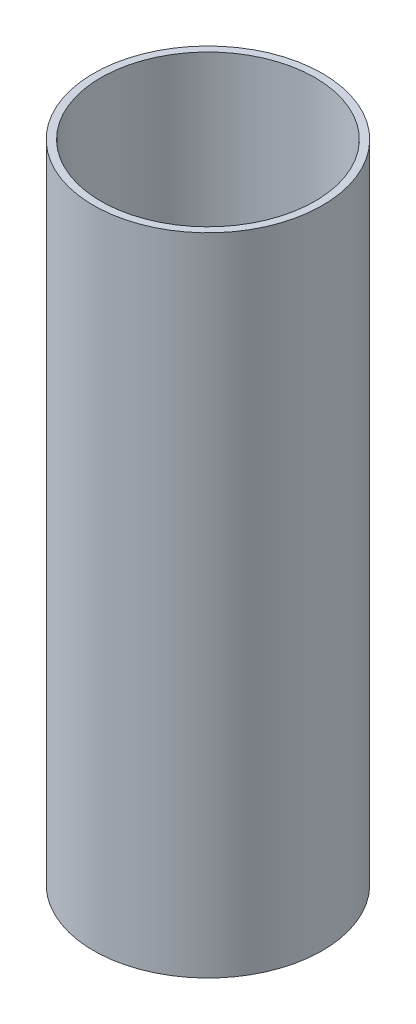
ISO-10303-21;
HEADER;
FILE_DESCRIPTION(('STEP AP214'),'2;1');
FILE_NAME('part.step','',(''),(''),'','','');
FILE_SCHEMA(('AUTOMOTIVE_DESIGN { 1 0 10303 214 1 1 1 1 }'));
ENDSEC;
DATA;
#1=APPLICATION_CONTEXT('core data for automotive mechanical design processes');
#2=APPLICATION_PROTOCOL_DEFINITION('international standard','automotive_design',2000,#1);
#3=PRODUCT_CONTEXT('',#1,'mechanical');
#4=PRODUCT('Part','Part','',(#3));
#5=PRODUCT_RELATED_PRODUCT_CATEGORY('part','',(#4));
#6=PRODUCT_DEFINITION_FORMATION('','',#4);
#7=PRODUCT_DEFINITION_CONTEXT('part definition',#1,'design');
#8=PRODUCT_DEFINITION('design','',#6,#7);
#9=PRODUCT_DEFINITION_SHAPE('','',#8);
#10=(LENGTH_UNIT() NAMED_UNIT(*) SI_UNIT(.MILLI.,.METRE.));
#11=(NAMED_UNIT(*) PLANE_ANGLE_UNIT() SI_UNIT($,.RADIAN.));
#12=(NAMED_UNIT(*) SI_UNIT($,.STERADIAN.) SOLID_ANGLE_UNIT());
#13=UNCERTAINTY_MEASURE_WITH_UNIT(LENGTH_MEASURE(1.E-05),#10,'distance_accuracy_value','');
#14=(GEOMETRIC_REPRESENTATION_CONTEXT(3) GLOBAL_UNCERTAINTY_ASSIGNED_CONTEXT((#13)) GLOBAL_UNIT_ASSIGNED_CONTEXT((#10,
#11,#12)) REPRESENTATION_CONTEXT('',''));
#15=CARTESIAN_POINT('',(0.,0.,0.));
#16=DIRECTION('',(0.,0.,1.));
#17=DIRECTION('',(1.,0.,0.));
#18=AXIS2_PLACEMENT_3D('',#15,#16,#17);
#19=CARTESIAN_POINT('',(0.,-13.97,0.));
#20=DIRECTION('',(0.,-1.,0.));
#21=DIRECTION('',(0.,0.,-1.));
#22=AXIS2_PLACEMENT_3D('',#19,#20,#21);
#23=CYLINDRICAL_SURFACE('',#22,46.355);
#24=CARTESIAN_POINT('',(0.,0.,0.));
#25=DIRECTION('',(0.,-1.,0.));
#26=DIRECTION('',(0.,0.,-1.));
#27=AXIS2_PLACEMENT_3D('',#24,#25,#26);
#28=CIRCLE('',#27,46.355);
#29=CARTESIAN_POINT('',(0.,0.,-46.355));
#30=VERTEX_POINT('',#29);
#31=EDGE_CURVE('E50',#30,#30,#28,.T.);
#32=ORIENTED_EDGE('',*,*,#31,.T.);
#33=EDGE_LOOP('',(#32));
#34=FACE_BOUND('',#33,.T.);
#35=CARTESIAN_POINT('',(0.,279.4,0.));
#36=DIRECTION('',(0.,-1.,0.));
#37=DIRECTION('',(0.,0.,-1.));
#38=AXIS2_PLACEMENT_3D('',#35,#36,#37);
#39=CIRCLE('',#38,46.355);
#40=CARTESIAN_POINT('',(0.,279.4,-46.355));
#41=VERTEX_POINT('',#40);
#42=EDGE_CURVE('E10',#41,#41,#39,.T.);
#43=ORIENTED_EDGE('',*,*,#42,.F.);
#44=EDGE_LOOP('',(#43));
#45=FACE_BOUND('',#44,.T.);
#46=ADVANCED_FACE('F36',(#34,#45),#23,.F.);
#47=CARTESIAN_POINT('',(46.355,279.4,0.));
#48=DIRECTION('',(0.,1.,0.));
#49=DIRECTION('',(0.,0.,1.));
#50=AXIS2_PLACEMENT_3D('',#47,#48,#49);
#51=PLANE('',#50);
#52=ORIENTED_EDGE('',*,*,#42,.T.);
#53=EDGE_LOOP('',(#52));
#54=FACE_BOUND('',#53,.T.);
#55=CARTESIAN_POINT('',(0.,279.4,0.));
#56=DIRECTION('',(0.,-1.,0.));
#57=DIRECTION('',(0.,0.,-1.));
#58=AXIS2_PLACEMENT_3D('',#55,#56,#57);
#59=CIRCLE('',#58,49.53);
#60=CARTESIAN_POINT('',(0.,279.4,-49.53));
#61=VERTEX_POINT('',#60);
#62=EDGE_CURVE('E42',#61,#61,#59,.T.);
#63=ORIENTED_EDGE('',*,*,#62,.F.);
#64=EDGE_LOOP('',(#63));
#65=FACE_BOUND('',#64,.T.);
#66=ADVANCED_FACE('F66',(#54,#65),#51,.T.);
#67=CARTESIAN_POINT('',(0.,-13.97,0.));
#68=DIRECTION('',(0.,-1.,0.));
#69=DIRECTION('',(0.,0.,-1.));
#70=AXIS2_PLACEMENT_3D('',#67,#68,#69);
#71=CYLINDRICAL_SURFACE('',#70,49.53);
#72=ORIENTED_EDGE('',*,*,#62,.T.);
#73=EDGE_LOOP('',(#72));
#74=FACE_BOUND('',#73,.T.);
#75=CARTESIAN_POINT('',(0.,0.,0.));
#76=DIRECTION('',(0.,-1.,0.));
#77=DIRECTION('',(0.,0.,-1.));
#78=AXIS2_PLACEMENT_3D('',#75,#76,#77);
#79=CIRCLE('',#78,49.53);
#80=CARTESIAN_POINT('',(0.,0.,-49.53));
#81=VERTEX_POINT('',#80);
#82=EDGE_CURVE('E46',#81,#81,#79,.T.);
#83=ORIENTED_EDGE('',*,*,#82,.F.);
#84=EDGE_LOOP('',(#83));
#85=FACE_BOUND('',#84,.T.);
#86=ADVANCED_FACE('F60',(#74,#85),#71,.T.);
#87=CARTESIAN_POINT('',(46.355,0.,0.));
#88=DIRECTION('',(0.,-1.,0.));
#89=DIRECTION('',(0.,0.,-1.));
#90=AXIS2_PLACEMENT_3D('',#87,#88,#89);
#91=PLANE('',#90);
#92=ORIENTED_EDGE('',*,*,#82,.T.);
#93=EDGE_LOOP('',(#92));
#94=FACE_BOUND('',#93,.T.);
#95=ORIENTED_EDGE('',*,*,#31,.F.);
#96=EDGE_LOOP('',(#95));
#97=FACE_BOUND('',#96,.T.);
#98=ADVANCED_FACE('F58',(#94,#97),#91,.T.);
#99=CLOSED_SHELL('',(#46,#66,#86,#98));
#100=MANIFOLD_SOLID_BREP('B2',#99);
#101=ADVANCED_BREP_SHAPE_REPRESENTATION('',(#18,#100),#14);
#102=SHAPE_DEFINITION_REPRESENTATION(#9,#101);
ENDSEC;
END-ISO-10303-21;
